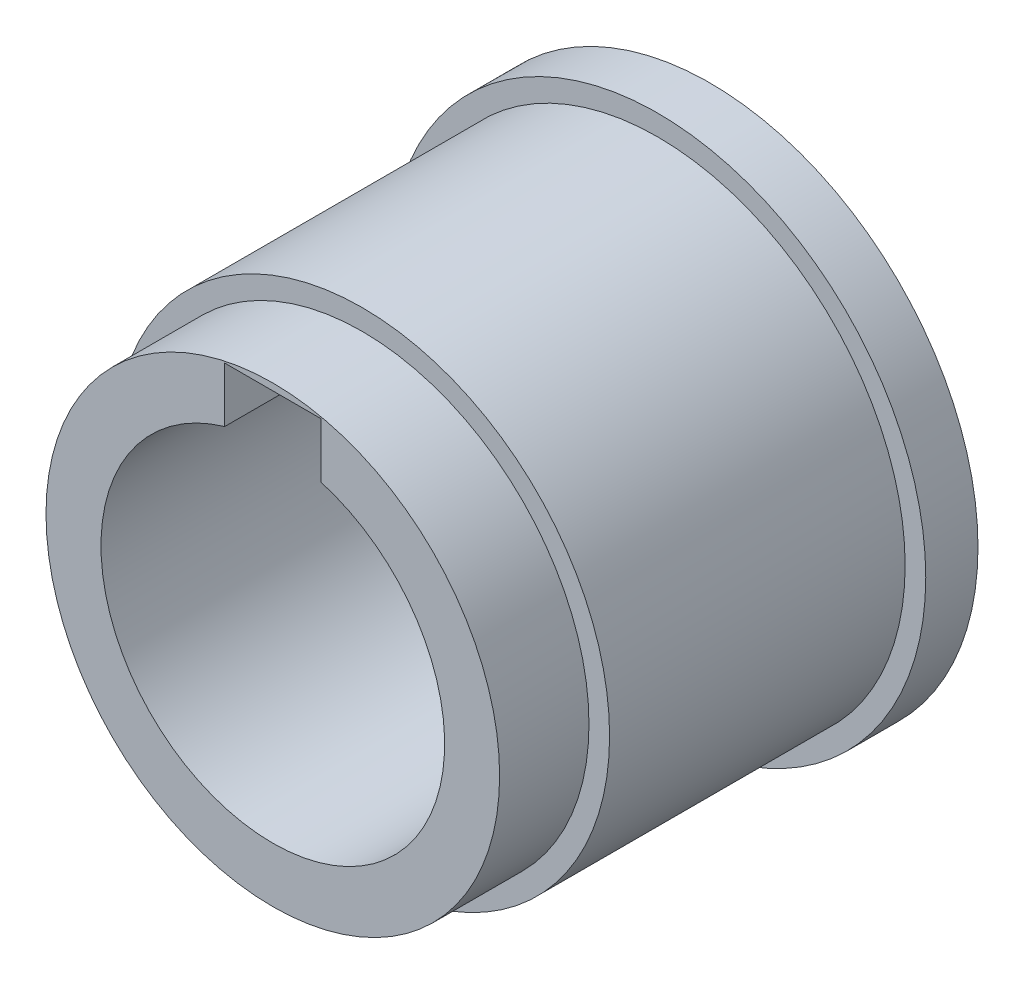
ISO-10303-21;
HEADER;
FILE_DESCRIPTION(('STEP AP214'),'2;1');
FILE_NAME('part.step','',(''),(''),'','','');
FILE_SCHEMA(('AUTOMOTIVE_DESIGN { 1 0 10303 214 1 1 1 1 }'));
ENDSEC;
DATA;
#1=APPLICATION_CONTEXT('core data for automotive mechanical design processes');
#2=APPLICATION_PROTOCOL_DEFINITION('international standard','automotive_design',2000,#1);
#3=PRODUCT_CONTEXT('',#1,'mechanical');
#4=PRODUCT('Part','Part','',(#3));
#5=PRODUCT_RELATED_PRODUCT_CATEGORY('part','',(#4));
#6=PRODUCT_DEFINITION_FORMATION('','',#4);
#7=PRODUCT_DEFINITION_CONTEXT('part definition',#1,'design');
#8=PRODUCT_DEFINITION('design','',#6,#7);
#9=PRODUCT_DEFINITION_SHAPE('','',#8);
#10=(LENGTH_UNIT() NAMED_UNIT(*) SI_UNIT(.MILLI.,.METRE.));
#11=(NAMED_UNIT(*) PLANE_ANGLE_UNIT() SI_UNIT($,.RADIAN.));
#12=(NAMED_UNIT(*) SI_UNIT($,.STERADIAN.) SOLID_ANGLE_UNIT());
#13=UNCERTAINTY_MEASURE_WITH_UNIT(LENGTH_MEASURE(1.E-05),#10,'distance_accuracy_value','');
#14=(GEOMETRIC_REPRESENTATION_CONTEXT(3) GLOBAL_UNCERTAINTY_ASSIGNED_CONTEXT((#13)) GLOBAL_UNIT_ASSIGNED_CONTEXT((#10,
#11,#12)) REPRESENTATION_CONTEXT('',''));
#15=CARTESIAN_POINT('',(0.,0.,0.));
#16=DIRECTION('',(0.,0.,1.));
#17=DIRECTION('',(1.,0.,0.));
#18=AXIS2_PLACEMENT_3D('',#15,#16,#17);
#19=CARTESIAN_POINT('',(0.,12.500000000001,-26.8));
#20=DIRECTION('',(0.,0.,1.));
#21=DIRECTION('',(1.,0.,0.));
#22=AXIS2_PLACEMENT_3D('',#19,#20,#21);
#23=PLANE('',#22);
#24=CARTESIAN_POINT('',(0.,0.,-26.8000000000002));
#25=DIRECTION('',(0.,0.,1.));
#26=DIRECTION('',(1.,0.,0.));
#27=AXIS2_PLACEMENT_3D('',#24,#25,#26);
#28=CIRCLE('',#27,19.500000000001);
#29=CARTESIAN_POINT('',(19.500000000001,0.,-26.8000000000002));
#30=VERTEX_POINT('',#29);
#31=EDGE_CURVE('E117',#30,#30,#28,.T.);
#32=ORIENTED_EDGE('',*,*,#31,.F.);
#33=EDGE_LOOP('',(#32));
#34=FACE_BOUND('',#33,.T.);
#35=DIRECTION('',(-1.,0.,0.));
#36=VECTOR('',#35,1.);
#37=CARTESIAN_POINT('',(-3.49999999998845,16.0000000000026,-26.8000000000002));
#38=LINE('',#37,#36);
#39=CARTESIAN_POINT('',(3.50000000001155,16.0000000000026,-26.8000000000002));
#40=VERTEX_POINT('',#39);
#41=CARTESIAN_POINT('',(-3.49999999998845,16.0000000000026,-26.8000000000002));
#42=VERTEX_POINT('',#41);
#43=EDGE_CURVE('E79',#40,#42,#38,.T.);
#44=ORIENTED_EDGE('',*,*,#43,.T.);
#45=DIRECTION('',(0.,-1.,0.));
#46=VECTOR('',#45,1.);
#47=CARTESIAN_POINT('',(-3.49999999998845,16.0000000000026,-26.8000000000002));
#48=LINE('',#47,#46);
#49=CARTESIAN_POINT('',(-3.49999999998845,12.0000000000044,-26.8000000000002));
#50=VERTEX_POINT('',#49);
#51=EDGE_CURVE('E88',#42,#50,#48,.T.);
#52=ORIENTED_EDGE('',*,*,#51,.T.);
#53=CARTESIAN_POINT('',(0.,0.,-26.8000000000002));
#54=DIRECTION('',(0.,0.,1.));
#55=DIRECTION('',(1.,0.,0.));
#56=AXIS2_PLACEMENT_3D('',#53,#54,#55);
#57=CIRCLE('',#56,12.500000000001);
#58=CARTESIAN_POINT('',(3.50000000001155,11.9999999999976,-26.8000000000002));
#59=VERTEX_POINT('',#58);
#60=EDGE_CURVE('E87',#50,#59,#57,.T.);
#61=ORIENTED_EDGE('',*,*,#60,.T.);
#62=DIRECTION('',(0.,1.,0.));
#63=VECTOR('',#62,1.);
#64=CARTESIAN_POINT('',(3.50000000001155,16.0000000000026,-26.8000000000002));
#65=LINE('',#64,#63);
#66=EDGE_CURVE('E47',#59,#40,#65,.T.);
#67=ORIENTED_EDGE('',*,*,#66,.T.);
#68=EDGE_LOOP('',(#44,#52,#61,#67));
#69=FACE_BOUND('',#68,.T.);
#70=ADVANCED_FACE('F33',(#34,#69),#23,.F.);
#71=CARTESIAN_POINT('',(0.,0.,1000.));
#72=DIRECTION('',(0.,0.,1.));
#73=DIRECTION('',(1.,0.,0.));
#74=AXIS2_PLACEMENT_3D('',#71,#72,#73);
#75=CYLINDRICAL_SURFACE('',#74,19.500000000001);
#76=CARTESIAN_POINT('',(0.,0.,-22.9999999999999));
#77=DIRECTION('',(0.,0.,1.));
#78=DIRECTION('',(1.,0.,0.));
#79=AXIS2_PLACEMENT_3D('',#76,#77,#78);
#80=CIRCLE('',#79,19.500000000001);
#81=CARTESIAN_POINT('',(19.500000000001,0.,-22.9999999999999));
#82=VERTEX_POINT('',#81);
#83=EDGE_CURVE('E114',#82,#82,#80,.T.);
#84=ORIENTED_EDGE('',*,*,#83,.F.);
#85=EDGE_LOOP('',(#84));
#86=FACE_BOUND('',#85,.T.);
#87=ORIENTED_EDGE('',*,*,#31,.T.);
#88=EDGE_LOOP('',(#87));
#89=FACE_BOUND('',#88,.T.);
#90=ADVANCED_FACE('F136',(#86,#89),#75,.T.);
#91=CARTESIAN_POINT('',(0.,19.500000000001,-23.));
#92=DIRECTION('',(0.,0.,-1.));
#93=DIRECTION('',(-1.,0.,0.));
#94=AXIS2_PLACEMENT_3D('',#91,#92,#93);
#95=PLANE('',#94);
#96=CARTESIAN_POINT('',(0.,0.,-22.9999999999999));
#97=DIRECTION('',(0.,0.,1.));
#98=DIRECTION('',(1.,0.,0.));
#99=AXIS2_PLACEMENT_3D('',#96,#97,#98);
#100=CIRCLE('',#99,18.000000000001);
#101=CARTESIAN_POINT('',(18.000000000001,0.,-22.9999999999999));
#102=VERTEX_POINT('',#101);
#103=EDGE_CURVE('E111',#102,#102,#100,.T.);
#104=ORIENTED_EDGE('',*,*,#103,.F.);
#105=EDGE_LOOP('',(#104));
#106=FACE_BOUND('',#105,.T.);
#107=ORIENTED_EDGE('',*,*,#83,.T.);
#108=EDGE_LOOP('',(#107));
#109=FACE_BOUND('',#108,.T.);
#110=ADVANCED_FACE('F141',(#106,#109),#95,.F.);
#111=CARTESIAN_POINT('',(0.,0.,1000.));
#112=DIRECTION('',(0.,0.,1.));
#113=DIRECTION('',(1.,0.,0.));
#114=AXIS2_PLACEMENT_3D('',#111,#112,#113);
#115=CYLINDRICAL_SURFACE('',#114,18.000000000001);
#116=CARTESIAN_POINT('',(0.,0.,-1.50000000000006));
#117=DIRECTION('',(0.,0.,1.));
#118=DIRECTION('',(1.,0.,0.));
#119=AXIS2_PLACEMENT_3D('',#116,#117,#118);
#120=CIRCLE('',#119,18.000000000001);
#121=CARTESIAN_POINT('',(18.000000000001,0.,-1.50000000000006));
#122=VERTEX_POINT('',#121);
#123=EDGE_CURVE('E108',#122,#122,#120,.T.);
#124=ORIENTED_EDGE('',*,*,#123,.F.);
#125=EDGE_LOOP('',(#124));
#126=FACE_BOUND('',#125,.T.);
#127=ORIENTED_EDGE('',*,*,#103,.T.);
#128=EDGE_LOOP('',(#127));
#129=FACE_BOUND('',#128,.T.);
#130=ADVANCED_FACE('F148',(#126,#129),#115,.T.);
#131=CARTESIAN_POINT('',(0.,18.000000000001,-1.5));
#132=DIRECTION('',(0.,0.,-1.));
#133=DIRECTION('',(-1.,0.,0.));
#134=AXIS2_PLACEMENT_3D('',#131,#132,#133);
#135=PLANE('',#134);
#136=CARTESIAN_POINT('',(0.,0.,-1.50000000000006));
#137=DIRECTION('',(0.,0.,1.));
#138=DIRECTION('',(1.,0.,0.));
#139=AXIS2_PLACEMENT_3D('',#136,#137,#138);
#140=CIRCLE('',#139,16.500000000001);
#141=CARTESIAN_POINT('',(16.500000000001,0.,-1.50000000000006));
#142=VERTEX_POINT('',#141);
#143=EDGE_CURVE('E105',#142,#142,#140,.T.);
#144=ORIENTED_EDGE('',*,*,#143,.F.);
#145=EDGE_LOOP('',(#144));
#146=FACE_BOUND('',#145,.T.);
#147=ORIENTED_EDGE('',*,*,#123,.T.);
#148=EDGE_LOOP('',(#147));
#149=FACE_BOUND('',#148,.T.);
#150=ADVANCED_FACE('F155',(#146,#149),#135,.F.);
#151=CARTESIAN_POINT('',(0.,0.,1000.));
#152=DIRECTION('',(0.,0.,1.));
#153=DIRECTION('',(1.,0.,0.));
#154=AXIS2_PLACEMENT_3D('',#151,#152,#153);
#155=CYLINDRICAL_SURFACE('',#154,16.500000000001);
#156=CARTESIAN_POINT('',(0.,0.,5.));
#157=DIRECTION('',(0.,0.,1.));
#158=DIRECTION('',(1.,0.,0.));
#159=AXIS2_PLACEMENT_3D('',#156,#157,#158);
#160=CIRCLE('',#159,16.500000000001);
#161=CARTESIAN_POINT('',(16.500000000001,0.,5.));
#162=VERTEX_POINT('',#161);
#163=EDGE_CURVE('E102',#162,#162,#160,.T.);
#164=ORIENTED_EDGE('',*,*,#163,.F.);
#165=EDGE_LOOP('',(#164));
#166=FACE_BOUND('',#165,.T.);
#167=ORIENTED_EDGE('',*,*,#143,.T.);
#168=EDGE_LOOP('',(#167));
#169=FACE_BOUND('',#168,.T.);
#170=ADVANCED_FACE('F159',(#166,#169),#155,.T.);
#171=CARTESIAN_POINT('',(0.,16.500000000001,5.));
#172=DIRECTION('',(0.,0.,-1.));
#173=DIRECTION('',(-1.,0.,0.));
#174=AXIS2_PLACEMENT_3D('',#171,#172,#173);
#175=PLANE('',#174);
#176=CARTESIAN_POINT('',(0.,0.,5.));
#177=DIRECTION('',(0.,0.,1.));
#178=DIRECTION('',(1.,0.,0.));
#179=AXIS2_PLACEMENT_3D('',#176,#177,#178);
#180=CIRCLE('',#179,12.500000000001);
#181=CARTESIAN_POINT('',(-3.49999999998845,12.0000000000044,5.));
#182=VERTEX_POINT('',#181);
#183=CARTESIAN_POINT('',(3.50000000001155,11.9999999999976,5.));
#184=VERTEX_POINT('',#183);
#185=EDGE_CURVE('E99',#182,#184,#180,.T.);
#186=ORIENTED_EDGE('',*,*,#185,.F.);
#187=DIRECTION('',(0.,-1.,0.));
#188=VECTOR('',#187,1.);
#189=CARTESIAN_POINT('',(-3.49999999998845,16.0000000000026,5.));
#190=LINE('',#189,#188);
#191=CARTESIAN_POINT('',(-3.49999999998845,16.0000000000026,5.));
#192=VERTEX_POINT('',#191);
#193=EDGE_CURVE('E93',#192,#182,#190,.T.);
#194=ORIENTED_EDGE('',*,*,#193,.F.);
#195=DIRECTION('',(-1.,0.,0.));
#196=VECTOR('',#195,1.);
#197=CARTESIAN_POINT('',(-3.49999999998845,16.0000000000026,5.));
#198=LINE('',#197,#196);
#199=CARTESIAN_POINT('',(3.50000000001155,16.0000000000026,5.));
#200=VERTEX_POINT('',#199);
#201=EDGE_CURVE('E90',#200,#192,#198,.T.);
#202=ORIENTED_EDGE('',*,*,#201,.F.);
#203=DIRECTION('',(0.,1.,0.));
#204=VECTOR('',#203,1.);
#205=CARTESIAN_POINT('',(3.50000000001155,16.0000000000026,5.));
#206=LINE('',#205,#204);
#207=EDGE_CURVE('E74',#184,#200,#206,.T.);
#208=ORIENTED_EDGE('',*,*,#207,.F.);
#209=EDGE_LOOP('',(#186,#194,#202,#208));
#210=FACE_BOUND('',#209,.T.);
#211=ORIENTED_EDGE('',*,*,#163,.T.);
#212=EDGE_LOOP('',(#211));
#213=FACE_BOUND('',#212,.T.);
#214=ADVANCED_FACE('F123',(#210,#213),#175,.F.);
#215=CARTESIAN_POINT('',(0.,0.,1000.));
#216=DIRECTION('',(0.,0.,1.));
#217=DIRECTION('',(1.,0.,0.));
#218=AXIS2_PLACEMENT_3D('',#215,#216,#217);
#219=CYLINDRICAL_SURFACE('',#218,12.500000000001);
#220=ORIENTED_EDGE('',*,*,#60,.F.);
#221=DIRECTION('',(0.,0.,1.));
#222=VECTOR('',#221,1.);
#223=CARTESIAN_POINT('',(-3.49999999998845,12.0000000000044,1000.));
#224=LINE('',#223,#222);
#225=EDGE_CURVE('E11',#50,#182,#224,.T.);
#226=ORIENTED_EDGE('',*,*,#225,.T.);
#227=ORIENTED_EDGE('',*,*,#185,.T.);
#228=DIRECTION('',(0.,0.,1.));
#229=VECTOR('',#228,1.);
#230=CARTESIAN_POINT('',(3.50000000001155,11.9999999999976,1000.));
#231=LINE('',#230,#229);
#232=EDGE_CURVE('E40',#184,#59,#231,.F.);
#233=ORIENTED_EDGE('',*,*,#232,.T.);
#234=EDGE_LOOP('',(#220,#226,#227,#233));
#235=FACE_BOUND('',#234,.T.);
#236=ADVANCED_FACE('F120',(#235),#219,.F.);
#237=CARTESIAN_POINT('',(-3.49999999998845,16.0000000000026,-26.8000000000002));
#238=DIRECTION('',(-1.,0.,0.));
#239=DIRECTION('',(0.,-1.,0.));
#240=AXIS2_PLACEMENT_3D('',#237,#238,#239);
#241=PLANE('',#240);
#242=ORIENTED_EDGE('',*,*,#51,.F.);
#243=DIRECTION('',(0.,0.,1.));
#244=VECTOR('',#243,1.);
#245=CARTESIAN_POINT('',(-3.49999999998845,16.0000000000026,-26.8000000000002));
#246=LINE('',#245,#244);
#247=EDGE_CURVE('E78',#42,#192,#246,.T.);
#248=ORIENTED_EDGE('',*,*,#247,.T.);
#249=ORIENTED_EDGE('',*,*,#193,.T.);
#250=ORIENTED_EDGE('',*,*,#225,.F.);
#251=EDGE_LOOP('',(#242,#248,#249,#250));
#252=FACE_BOUND('',#251,.T.);
#253=ADVANCED_FACE('F126',(#252),#241,.F.);
#254=CARTESIAN_POINT('',(3.50000000001155,16.0000000000026,-26.8000000000002));
#255=DIRECTION('',(1.,0.,0.));
#256=DIRECTION('',(0.,1.,0.));
#257=AXIS2_PLACEMENT_3D('',#254,#255,#256);
#258=PLANE('',#257);
#259=ORIENTED_EDGE('',*,*,#207,.T.);
#260=DIRECTION('',(0.,0.,1.));
#261=VECTOR('',#260,1.);
#262=CARTESIAN_POINT('',(3.50000000001155,16.0000000000026,-26.8000000000002));
#263=LINE('',#262,#261);
#264=EDGE_CURVE('E70',#40,#200,#263,.T.);
#265=ORIENTED_EDGE('',*,*,#264,.F.);
#266=ORIENTED_EDGE('',*,*,#66,.F.);
#267=ORIENTED_EDGE('',*,*,#232,.F.);
#268=EDGE_LOOP('',(#259,#265,#266,#267));
#269=FACE_BOUND('',#268,.T.);
#270=ADVANCED_FACE('F72',(#269),#258,.F.);
#271=CARTESIAN_POINT('',(-3.49999999998845,16.0000000000026,-26.8000000000002));
#272=DIRECTION('',(0.,1.,0.));
#273=DIRECTION('',(0.,0.,1.));
#274=AXIS2_PLACEMENT_3D('',#271,#272,#273);
#275=PLANE('',#274);
#276=ORIENTED_EDGE('',*,*,#201,.T.);
#277=ORIENTED_EDGE('',*,*,#247,.F.);
#278=ORIENTED_EDGE('',*,*,#43,.F.);
#279=ORIENTED_EDGE('',*,*,#264,.T.);
#280=EDGE_LOOP('',(#276,#277,#278,#279));
#281=FACE_BOUND('',#280,.T.);
#282=ADVANCED_FACE('F82',(#281),#275,.F.);
#283=CLOSED_SHELL('',(#70,#90,#110,#130,#150,#170,#214,#236,#253,#270,#282));
#284=MANIFOLD_SOLID_BREP('B2',#283);
#285=ADVANCED_BREP_SHAPE_REPRESENTATION('',(#18,#284),#14);
#286=SHAPE_DEFINITION_REPRESENTATION(#9,#285);
ENDSEC;
END-ISO-10303-21;
